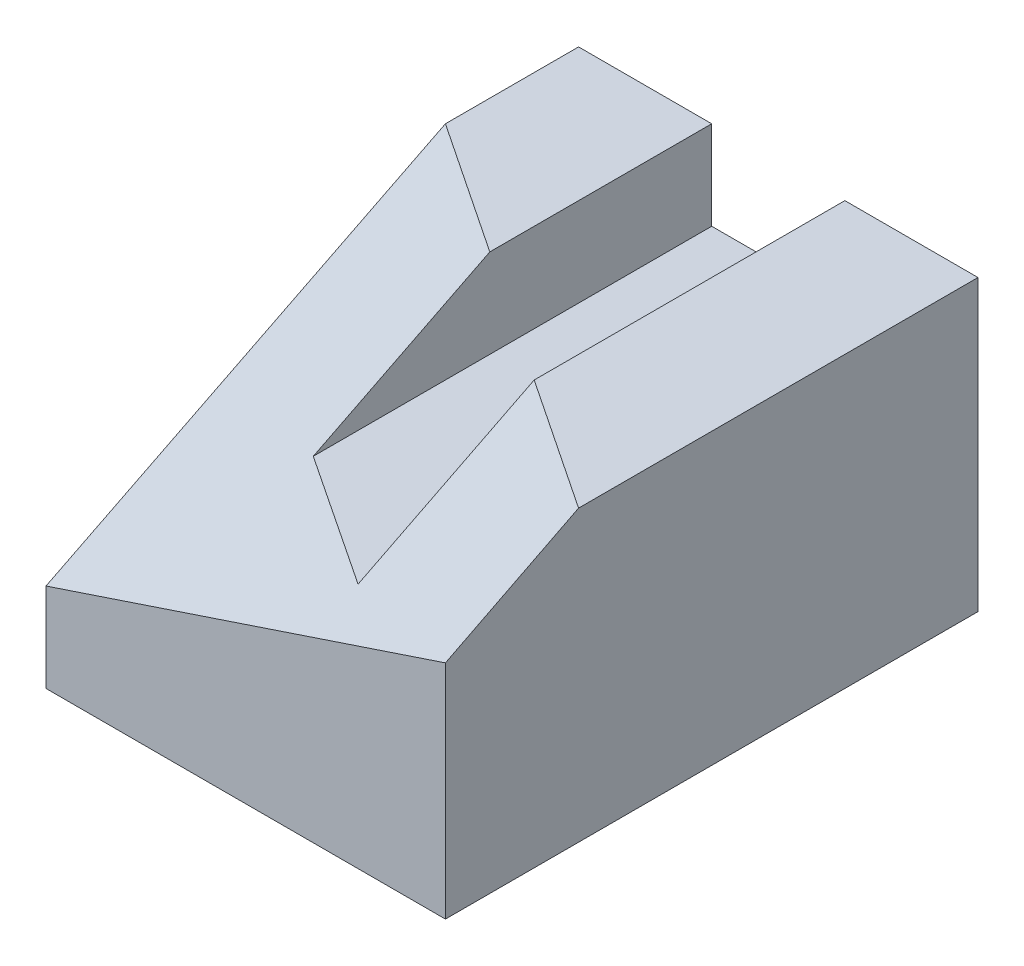
ISO-10303-21;
HEADER;
FILE_DESCRIPTION(('STEP AP214'),'2;1');
FILE_NAME('part.step','',(''),(''),'','','');
FILE_SCHEMA(('AUTOMOTIVE_DESIGN { 1 0 10303 214 1 1 1 1 }'));
ENDSEC;
DATA;
#1=APPLICATION_CONTEXT('core data for automotive mechanical design processes');
#2=APPLICATION_PROTOCOL_DEFINITION('international standard','automotive_design',2000,#1);
#3=PRODUCT_CONTEXT('',#1,'mechanical');
#4=PRODUCT('Part','Part','',(#3));
#5=PRODUCT_RELATED_PRODUCT_CATEGORY('part','',(#4));
#6=PRODUCT_DEFINITION_FORMATION('','',#4);
#7=PRODUCT_DEFINITION_CONTEXT('part definition',#1,'design');
#8=PRODUCT_DEFINITION('design','',#6,#7);
#9=PRODUCT_DEFINITION_SHAPE('','',#8);
#10=(LENGTH_UNIT() NAMED_UNIT(*) SI_UNIT(.MILLI.,.METRE.));
#11=(NAMED_UNIT(*) PLANE_ANGLE_UNIT() SI_UNIT($,.RADIAN.));
#12=(NAMED_UNIT(*) SI_UNIT($,.STERADIAN.) SOLID_ANGLE_UNIT());
#13=UNCERTAINTY_MEASURE_WITH_UNIT(LENGTH_MEASURE(1.E-05),#10,'distance_accuracy_value','');
#14=(GEOMETRIC_REPRESENTATION_CONTEXT(3) GLOBAL_UNCERTAINTY_ASSIGNED_CONTEXT((#13)) GLOBAL_UNIT_ASSIGNED_CONTEXT((#10,
#11,#12)) REPRESENTATION_CONTEXT('',''));
#15=CARTESIAN_POINT('',(0.,0.,0.));
#16=DIRECTION('',(0.,0.,1.));
#17=DIRECTION('',(1.,0.,0.));
#18=AXIS2_PLACEMENT_3D('',#15,#16,#17);
#19=CARTESIAN_POINT('',(0.,41.402,76.2));
#20=DIRECTION('',(1.,0.,0.));
#21=DIRECTION('',(0.,0.,-1.));
#22=AXIS2_PLACEMENT_3D('',#19,#20,#21);
#23=PLANE('',#22);
#24=CARTESIAN_POINT('',(-2.91809074732152E-05,41.4020872516244,19.0500439172954));
#25=CARTESIAN_POINT('',(-3.86726969360766E-06,40.2060948844264,21.4312558444124));
#26=CARTESIAN_POINT('',(1.08937333364729E-05,39.0101340837386,23.812483625628));
#27=CARTESIAN_POINT('',(2.7901925962563E-05,36.6182498990808,28.5749580211406));
#28=CARTESIAN_POINT('',(3.01491153867756E-05,35.4223265151114,30.9562046354378));
#29=CARTESIAN_POINT('',(3.07211366442106E-05,33.0304914748033,35.7187037678096));
#30=CARTESIAN_POINT('',(2.90459684589946E-05,31.8345798184648,38.0999562858842));
#31=CARTESIAN_POINT('',(2.85221628713324E-05,29.4427480526273,42.8624570716149));
#32=CARTESIAN_POINT('',(2.9673525464064E-05,28.2468279431284,45.243705339271));
#33=CARTESIAN_POINT('',(3.37831016135124E-05,25.8549823215601,50.0061991553545));
#34=CARTESIAN_POINT('',(3.67413151666484E-05,24.6590568094907,52.387444703782));
#35=CARTESIAN_POINT('',(4.33074200695613E-05,22.2672038421352,57.1499348241936));
#36=CARTESIAN_POINT('',(4.6915311419231E-05,21.0712763868492,59.5311793961778));
#37=CARTESIAN_POINT('',(5.06189575230314E-05,18.6794319771262,64.2936738269605));
#38=CARTESIAN_POINT('',(5.07147122619176E-05,17.4835150226893,66.6749236857591));
#39=CARTESIAN_POINT('',(4.08956505829022E-05,15.0917110457558,71.4374384690995));
#40=CARTESIAN_POINT('',(3.09808340523172E-05,13.8958240232596,73.8187033936416));
#41=CARTESIAN_POINT('',(1.28115145148336E-05,12.6999616931459,76.1999807188834));
#42=B_SPLINE_CURVE_WITH_KNOTS('',3,(#24,#25,#26,#27,#28,#29,#30,#31,#32,#33,#34,#35,#36,#37,#38,
#39,#40,#41),.UNSPECIFIED.,.F.,.F.,(4,2,2,2,2,2,2,2,4),(0.,7.99406729060848,15.9881346909643,
23.9822021288993,31.976269553196,39.9703369616497,47.9644043687831,55.9584718106146,
63.9525393424309),.UNSPECIFIED.);
#43=CARTESIAN_POINT('',(0.,12.6999738701639,76.2));
#44=VERTEX_POINT('',#43);
#45=CARTESIAN_POINT('',(0.,41.402,19.0501185446108));
#46=VERTEX_POINT('',#45);
#47=EDGE_CURVE('E90',#44,#46,#42,.F.);
#48=ORIENTED_EDGE('',*,*,#47,.T.);
#49=DIRECTION('',(0.,0.,-1.));
#50=VECTOR('',#49,1.);
#51=CARTESIAN_POINT('',(0.,41.402,76.2));
#52=LINE('',#51,#50);
#53=CARTESIAN_POINT('',(0.,41.402,0.));
#54=VERTEX_POINT('',#53);
#55=EDGE_CURVE('E131',#46,#54,#52,.T.);
#56=ORIENTED_EDGE('',*,*,#55,.T.);
#57=DIRECTION('',(0.,-1.,0.));
#58=VECTOR('',#57,1.);
#59=CARTESIAN_POINT('',(0.,41.402,0.));
#60=LINE('',#59,#58);
#61=CARTESIAN_POINT('',(0.,0.,0.));
#62=VERTEX_POINT('',#61);
#63=EDGE_CURVE('E135',#54,#62,#60,.T.);
#64=ORIENTED_EDGE('',*,*,#63,.T.);
#65=DIRECTION('',(0.,0.,-1.));
#66=VECTOR('',#65,1.);
#67=CARTESIAN_POINT('',(0.,0.,76.2));
#68=LINE('',#67,#66);
#69=CARTESIAN_POINT('',(0.,0.,76.2));
#70=VERTEX_POINT('',#69);
#71=EDGE_CURVE('E12',#70,#62,#68,.T.);
#72=ORIENTED_EDGE('',*,*,#71,.F.);
#73=DIRECTION('',(0.,-1.,0.));
#74=VECTOR('',#73,1.);
#75=CARTESIAN_POINT('',(0.,41.402,76.2));
#76=LINE('',#75,#74);
#77=EDGE_CURVE('E152',#44,#70,#76,.T.);
#78=ORIENTED_EDGE('',*,*,#77,.F.);
#79=EDGE_LOOP('',(#48,#56,#64,#72,#78));
#80=FACE_BOUND('',#79,.T.);
#81=ADVANCED_FACE('F71',(#80),#23,.F.);
#82=CARTESIAN_POINT('',(57.15,0.,76.2));
#83=DIRECTION('',(-1.,0.,0.));
#84=DIRECTION('',(0.,0.,1.));
#85=AXIS2_PLACEMENT_3D('',#82,#83,#84);
#86=PLANE('',#85);
#87=CARTESIAN_POINT('',(57.1498357322781,31.7504911659455,76.2002472201925));
#88=CARTESIAN_POINT('',(57.1498786890292,32.1525294469912,75.4064324594984));
#89=CARTESIAN_POINT('',(57.1499060467602,32.5546143101466,74.6126412924623));
#90=CARTESIAN_POINT('',(57.149935006437,33.358861047111,73.0250977204189));
#91=CARTESIAN_POINT('',(57.1499366083764,33.7610229209394,72.2313453154215));
#92=CARTESIAN_POINT('',(57.1499194987068,34.5654074030927,70.6438710842562));
#93=CARTESIAN_POINT('',(57.149900787094,34.9676300114297,69.8501492580945));
#94=CARTESIAN_POINT('',(57.1498530846375,35.7721059599499,68.2627210825443));
#95=CARTESIAN_POINT('',(57.1498240937928,36.1743593001362,67.4690147331575));
#96=CARTESIAN_POINT('',(57.1497702222967,36.9788536880135,65.8815958542968));
#97=CARTESIAN_POINT('',(57.149745341645,37.3810947357052,65.0878833248233));
#98=CARTESIAN_POINT('',(57.1497185257611,38.1855082188033,63.5004237427156));
#99=CARTESIAN_POINT('',(57.1497165905231,38.5876806542268,62.70667669009));
#100=CARTESIAN_POINT('',(57.1497636309434,39.3918733089801,61.1191059466711));
#101=CARTESIAN_POINT('',(57.1498126065775,39.7938935283825,60.3252822559144));
#102=CARTESIAN_POINT('',(57.1499832464399,40.597716625876,58.7375254792739));
#103=CARTESIAN_POINT('',(57.1501049106226,40.999519504103,57.9435923934589));
#104=CARTESIAN_POINT('',(57.1502738079575,41.4011813051102,57.1495879235721));
#105=B_SPLINE_CURVE_WITH_KNOTS('',3,(#87,#88,#89,#90,#91,#92,#93,#94,#95,#96,#97,#98,#99,#100,
#101,#102,#103,#104),.UNSPECIFIED.,.F.,.F.,(4,2,2,2,2,2,2,2,4),(0.,2.66945497720861,
5.33891062507232,8.00836680017314,10.6778232386596,13.3472795429308,16.016735185038,
18.6861895535327,21.3556422493235),.UNSPECIFIED.);
#106=CARTESIAN_POINT('',(57.15,41.402,57.1488935706619));
#107=VERTEX_POINT('',#106);
#108=CARTESIAN_POINT('',(57.15,31.7503355829927,76.2));
#109=VERTEX_POINT('',#108);
#110=EDGE_CURVE('E294',#107,#109,#105,.F.);
#111=ORIENTED_EDGE('',*,*,#110,.T.);
#112=DIRECTION('',(0.,1.,0.));
#113=VECTOR('',#112,1.);
#114=CARTESIAN_POINT('',(57.15,0.,76.2));
#115=LINE('',#114,#113);
#116=CARTESIAN_POINT('',(57.15,0.,76.2));
#117=VERTEX_POINT('',#116);
#118=EDGE_CURVE('E142',#117,#109,#115,.T.);
#119=ORIENTED_EDGE('',*,*,#118,.F.);
#120=DIRECTION('',(0.,0.,-1.));
#121=VECTOR('',#120,1.);
#122=CARTESIAN_POINT('',(57.15,0.,76.2));
#123=LINE('',#122,#121);
#124=CARTESIAN_POINT('',(57.15,0.,0.));
#125=VERTEX_POINT('',#124);
#126=EDGE_CURVE('E82',#117,#125,#123,.T.);
#127=ORIENTED_EDGE('',*,*,#126,.T.);
#128=DIRECTION('',(0.,1.,0.));
#129=VECTOR('',#128,1.);
#130=CARTESIAN_POINT('',(57.15,0.,0.));
#131=LINE('',#130,#129);
#132=CARTESIAN_POINT('',(57.15,41.402,0.));
#133=VERTEX_POINT('',#132);
#134=EDGE_CURVE('E163',#125,#133,#131,.T.);
#135=ORIENTED_EDGE('',*,*,#134,.T.);
#136=DIRECTION('',(0.,0.,-1.));
#137=VECTOR('',#136,1.);
#138=CARTESIAN_POINT('',(57.15,41.402,76.2));
#139=LINE('',#138,#137);
#140=EDGE_CURVE('E310',#107,#133,#139,.T.);
#141=ORIENTED_EDGE('',*,*,#140,.F.);
#142=EDGE_LOOP('',(#111,#119,#127,#135,#141));
#143=FACE_BOUND('',#142,.T.);
#144=ADVANCED_FACE('F334',(#143),#86,.F.);
#145=CARTESIAN_POINT('',(57.15,41.402,76.2));
#146=DIRECTION('',(0.,-1.,0.));
#147=DIRECTION('',(0.,0.,-1.));
#148=AXIS2_PLACEMENT_3D('',#145,#146,#147);
#149=PLANE('',#148);
#150=CARTESIAN_POINT('',(57.1502738079575,41.4011813051101,57.1495879235721));
#151=CARTESIAN_POINT('',(56.356397219837,41.4015616440852,56.620613103614));
#152=CARTESIAN_POINT('',(55.5625511410936,41.4018508696437,56.0915924479037));
#153=CARTESIAN_POINT('',(53.9749057358549,41.4022895299853,55.033480775126));
#154=CARTESIAN_POINT('',(53.1811064093637,41.4024389647563,54.5043897580525));
#155=CARTESIAN_POINT('',(51.5935403185633,41.4026404795367,53.4461587236243));
#156=CARTESIAN_POINT('',(50.7997735542567,41.4026925595384,52.9170187062655));
#157=CARTESIAN_POINT('',(49.2122609142742,41.4027342620101,51.8587072346279));
#158=CARTESIAN_POINT('',(48.4185150385995,41.4027238844763,51.3295357803471));
#159=CARTESIAN_POINT('',(46.8310347816854,41.4026687594675,50.2711755719813));
#160=CARTESIAN_POINT('',(46.0373004004462,41.4026240119913,49.7419868178956));
#161=CARTESIAN_POINT('',(44.4498361747791,41.4025209495707,48.6836024802632));
#162=CARTESIAN_POINT('',(43.6561063303511,41.4024626346263,48.1544068967164));
#163=CARTESIAN_POINT('',(42.0686463386201,41.4023469074693,47.0960161833569));
#164=CARTESIAN_POINT('',(41.2749161913171,41.4022894952568,46.5668210535442));
#165=CARTESIAN_POINT('',(39.6874530379899,41.4021832185025,45.5084350962465));
#166=CARTESIAN_POINT('',(38.8937200319659,41.4021343539607,44.9792442687614));
#167=CARTESIAN_POINT('',(38.0999843114575,41.4020935857229,44.4500575119357));
#168=B_SPLINE_CURVE_WITH_KNOTS('',3,(#150,#151,#152,#153,#154,#155,#156,#157,#158,#159,#160,
#161,#162,#163,#164,#165,#166,#167),.UNSPECIFIED.,.F.,.F.,(4,2,2,2,2,2,2,2,4),(0.,
2.86190334635929,5.72380694455233,8.58571077085884,11.4476147664134,14.309518864249,
17.1714230056915,20.0333271478418,22.8952312643818),.UNSPECIFIED.);
#169=CARTESIAN_POINT('',(38.1,41.402,44.4501269241652));
#170=VERTEX_POINT('',#169);
#171=EDGE_CURVE('E288',#170,#107,#168,.F.);
#172=ORIENTED_EDGE('',*,*,#171,.T.);
#173=ORIENTED_EDGE('',*,*,#140,.T.);
#174=DIRECTION('',(-1.,0.,0.));
#175=VECTOR('',#174,1.);
#176=CARTESIAN_POINT('',(57.15,41.402,0.));
#177=LINE('',#176,#175);
#178=CARTESIAN_POINT('',(38.1,41.402,0.));
#179=VERTEX_POINT('',#178);
#180=EDGE_CURVE('E175',#133,#179,#177,.T.);
#181=ORIENTED_EDGE('',*,*,#180,.T.);
#182=DIRECTION('',(0.,0.,-1.));
#183=VECTOR('',#182,1.);
#184=CARTESIAN_POINT('',(38.1,41.402,76.2));
#185=LINE('',#184,#183);
#186=EDGE_CURVE('E209',#170,#179,#185,.T.);
#187=ORIENTED_EDGE('',*,*,#186,.F.);
#188=EDGE_LOOP('',(#172,#173,#181,#187));
#189=FACE_BOUND('',#188,.T.);
#190=ADVANCED_FACE('F306',(#189),#149,.F.);
#191=CARTESIAN_POINT('',(38.1,41.402,76.2));
#192=DIRECTION('',(1.,0.,0.));
#193=DIRECTION('',(0.,0.,-1.));
#194=AXIS2_PLACEMENT_3D('',#191,#192,#193);
#195=PLANE('',#194);
#196=CARTESIAN_POINT('',(38.1,41.402,44.4502538483304));
#197=CARTESIAN_POINT('',(38.1,40.3444915757385,46.5506797572014));
#198=CARTESIAN_POINT('',(38.1,39.2867169144591,48.6509716064659));
#199=CARTESIAN_POINT('',(38.1,37.1707022640614,52.8513208214827));
#200=CARTESIAN_POINT('',(38.1,36.1124622749551,54.9513781872411));
#201=CARTESIAN_POINT('',(38.1,33.9955840664031,59.1512921676664));
#202=CARTESIAN_POINT('',(38.1,32.9369458469595,61.2511487823343));
#203=CARTESIAN_POINT('',(38.1,30.8195213794308,65.4507874483911));
#204=CARTESIAN_POINT('',(38.1,29.7607351313419,67.5505694997781));
#205=CARTESIAN_POINT('',(38.0999999999999,28.702,69.6503773035042));
#206=B_SPLINE_CURVE_WITH_KNOTS('',3,(#196,#197,#198,#199,#200,#201,#202,#203,#204,#205),
.UNSPECIFIED.,.F.,.F.,(4,2,2,2,4),(0.,7.05485769254466,14.1097152032002,21.16457267494,
28.2194303285688),.UNSPECIFIED.);
#207=CARTESIAN_POINT('',(38.1,28.702,69.6503773035042));
#208=VERTEX_POINT('',#207);
#209=EDGE_CURVE('E159',#170,#208,#206,.T.);
#210=ORIENTED_EDGE('',*,*,#209,.F.);
#211=ORIENTED_EDGE('',*,*,#186,.T.);
#212=DIRECTION('',(0.,-1.,0.));
#213=VECTOR('',#212,1.);
#214=CARTESIAN_POINT('',(38.1,41.402,0.));
#215=LINE('',#214,#213);
#216=CARTESIAN_POINT('',(38.1,28.702,0.));
#217=VERTEX_POINT('',#216);
#218=EDGE_CURVE('E179',#179,#217,#215,.T.);
#219=ORIENTED_EDGE('',*,*,#218,.T.);
#220=DIRECTION('',(0.,0.,-1.));
#221=VECTOR('',#220,1.);
#222=CARTESIAN_POINT('',(38.1,28.702,76.2));
#223=LINE('',#222,#221);
#224=EDGE_CURVE('E305',#208,#217,#223,.T.);
#225=ORIENTED_EDGE('',*,*,#224,.F.);
#226=EDGE_LOOP('',(#210,#211,#219,#225));
#227=FACE_BOUND('',#226,.T.);
#228=ADVANCED_FACE('F304',(#227),#195,.F.);
#229=CARTESIAN_POINT('',(38.1,28.702,76.2));
#230=DIRECTION('',(0.,-1.,0.));
#231=DIRECTION('',(0.,0.,-1.));
#232=AXIS2_PLACEMENT_3D('',#229,#230,#231);
#233=PLANE('',#232);
#234=CARTESIAN_POINT('',(38.1,28.702,69.6503773035042));
#235=CARTESIAN_POINT('',(36.5114664016894,28.702,68.5983746399323));
#236=CARTESIAN_POINT('',(34.9232921964086,28.702,67.5458296059487));
#237=CARTESIAN_POINT('',(31.7475050892172,28.702,65.4398935845226));
#238=CARTESIAN_POINT('',(30.1598921872174,28.702,64.3865025972146));
#239=CARTESIAN_POINT('',(26.9850697402661,28.702,62.2791131493097));
#240=CARTESIAN_POINT('',(25.3978601953043,28.702,61.2251146887286));
#241=CARTESIAN_POINT('',(22.2237359530104,28.702,59.116673329893));
#242=CARTESIAN_POINT('',(20.6368212557253,28.702,58.0622304315679));
#243=CARTESIAN_POINT('',(19.05,28.702,57.0076470131161));
#244=B_SPLINE_CURVE_WITH_KNOTS('',3,(#234,#235,#236,#237,#238,#239,#240,#241,#242,#243),
.UNSPECIFIED.,.F.,.F.,(4,2,2,2,4),(0.,5.71588429469036,11.431767681691,17.1476509218171,
22.8635350696328),.UNSPECIFIED.);
#245=CARTESIAN_POINT('',(19.05,28.702,57.0076470131161));
#246=VERTEX_POINT('',#245);
#247=EDGE_CURVE('E166',#208,#246,#244,.T.);
#248=ORIENTED_EDGE('',*,*,#247,.F.);
#249=ORIENTED_EDGE('',*,*,#224,.T.);
#250=DIRECTION('',(-1.,0.,0.));
#251=VECTOR('',#250,1.);
#252=CARTESIAN_POINT('',(38.1,28.702,0.));
#253=LINE('',#252,#251);
#254=CARTESIAN_POINT('',(19.05,28.702,0.));
#255=VERTEX_POINT('',#254);
#256=EDGE_CURVE('E183',#217,#255,#253,.T.);
#257=ORIENTED_EDGE('',*,*,#256,.T.);
#258=DIRECTION('',(0.,0.,-1.));
#259=VECTOR('',#258,1.);
#260=CARTESIAN_POINT('',(19.05,28.702,76.2));
#261=LINE('',#260,#259);
#262=EDGE_CURVE('E201',#246,#255,#261,.T.);
#263=ORIENTED_EDGE('',*,*,#262,.F.);
#264=EDGE_LOOP('',(#248,#249,#257,#263));
#265=FACE_BOUND('',#264,.T.);
#266=ADVANCED_FACE('F226',(#265),#233,.F.);
#267=CARTESIAN_POINT('',(19.05,28.702,76.2));
#268=DIRECTION('',(-1.,0.,0.));
#269=DIRECTION('',(0.,0.,1.));
#270=AXIS2_PLACEMENT_3D('',#267,#268,#269);
#271=PLANE('',#270);
#272=CARTESIAN_POINT('',(19.05,28.702,57.0076470131161));
#273=CARTESIAN_POINT('',(19.05,30.8189587749931,52.7982338417646));
#274=CARTESIAN_POINT('',(19.05,32.935771495823,48.5887472309146));
#275=CARTESIAN_POINT('',(19.05,37.1691048291563,40.1696271302178));
#276=CARTESIAN_POINT('',(19.05,39.2856254416597,35.959993640371));
#277=CARTESIAN_POINT('',(19.05,41.4019999999999,31.7502867110257));
#278=B_SPLINE_CURVE_WITH_KNOTS('',3,(#272,#273,#274,#275,#276,#277),.UNSPECIFIED.,.F.,.F.,(4,2,
4),(0.,14.1352772380993,28.2705544761987),.UNSPECIFIED.);
#279=CARTESIAN_POINT('',(19.05,41.402,31.7501433555129));
#280=VERTEX_POINT('',#279);
#281=EDGE_CURVE('E239',#246,#280,#278,.T.);
#282=ORIENTED_EDGE('',*,*,#281,.F.);
#283=ORIENTED_EDGE('',*,*,#262,.T.);
#284=DIRECTION('',(0.,1.,0.));
#285=VECTOR('',#284,1.);
#286=CARTESIAN_POINT('',(19.05,28.702,0.));
#287=LINE('',#286,#285);
#288=CARTESIAN_POINT('',(19.05,41.402,0.));
#289=VERTEX_POINT('',#288);
#290=EDGE_CURVE('E153',#255,#289,#287,.T.);
#291=ORIENTED_EDGE('',*,*,#290,.T.);
#292=DIRECTION('',(0.,0.,-1.));
#293=VECTOR('',#292,1.);
#294=CARTESIAN_POINT('',(19.05,41.402,76.2));
#295=LINE('',#294,#293);
#296=EDGE_CURVE('E141',#280,#289,#295,.T.);
#297=ORIENTED_EDGE('',*,*,#296,.F.);
#298=EDGE_LOOP('',(#282,#283,#291,#297));
#299=FACE_BOUND('',#298,.T.);
#300=ADVANCED_FACE('F222',(#299),#271,.F.);
#301=CARTESIAN_POINT('',(19.05,41.402,76.2));
#302=DIRECTION('',(0.,-1.,0.));
#303=DIRECTION('',(0.,0.,-1.));
#304=AXIS2_PLACEMENT_3D('',#301,#302,#303);
#305=PLANE('',#304);
#306=CARTESIAN_POINT('',(19.0500307705535,41.4021055875975,31.7500972015834));
#307=CARTESIAN_POINT('',(18.2562725238162,41.4021220087437,31.2209369637095));
#308=CARTESIAN_POINT('',(17.4625147990808,41.4021368725621,30.6917759427555));
#309=CARTESIAN_POINT('',(15.8750007126123,41.4021625247767,29.6334518495515));
#310=CARTESIAN_POINT('',(15.0812443508792,41.4021733131727,29.1042887773016));
#311=CARTESIAN_POINT('',(13.4937333118264,41.4021898537752,28.045960097978));
#312=CARTESIAN_POINT('',(12.6999786345066,41.4021956059816,27.5167944909044));
#313=CARTESIAN_POINT('',(11.1124710471365,41.4022018263845,26.4584606171799));
#314=CARTESIAN_POINT('',(10.3187181370861,41.4022022945809,25.929292350529));
#315=CARTESIAN_POINT('',(8.73121400629917,41.4021981800747,24.8709532749871));
#316=CARTESIAN_POINT('',(7.93746278556265,41.4021935973721,24.341782466096));
#317=CARTESIAN_POINT('',(6.34996178058207,41.4021801369867,23.2834386865477));
#318=CARTESIAN_POINT('',(5.55621199633803,41.4021712593041,22.7542657158903));
#319=CARTESIAN_POINT('',(3.96871346203845,41.4021504119532,21.6959182183368));
#320=CARTESIAN_POINT('',(3.17496471198292,41.402138442285,21.1667436914407));
#321=CARTESIAN_POINT('',(1.58746761803138,41.402113288518,20.1083940263852));
#322=CARTESIAN_POINT('',(0.793719274135367,41.4021001044192,19.5792188882258));
#323=CARTESIAN_POINT('',(-2.9180907479734E-05,41.4020872518828,19.050043916781));
#324=B_SPLINE_CURVE_WITH_KNOTS('',3,(#306,#307,#308,#309,#310,#311,#312,#313,#314,#315,#316,
#317,#318,#319,#320,#321,#322,#323),.UNSPECIFIED.,.F.,.F.,(4,2,2,2,2,2,2,2,4),(0.,
2.86191621242914,5.72383243593988,8.58574867291644,11.4476649242565,14.3095811894056,
17.1714974663791,20.0334137517466,22.8953300405462),.UNSPECIFIED.);
#325=EDGE_CURVE('E204',#46,#280,#324,.F.);
#326=ORIENTED_EDGE('',*,*,#325,.T.);
#327=ORIENTED_EDGE('',*,*,#296,.T.);
#328=DIRECTION('',(-1.,0.,0.));
#329=VECTOR('',#328,1.);
#330=CARTESIAN_POINT('',(19.05,41.402,0.));
#331=LINE('',#330,#329);
#332=EDGE_CURVE('E145',#289,#54,#331,.T.);
#333=ORIENTED_EDGE('',*,*,#332,.T.);
#334=ORIENTED_EDGE('',*,*,#55,.F.);
#335=EDGE_LOOP('',(#326,#327,#333,#334));
#336=FACE_BOUND('',#335,.T.);
#337=ADVANCED_FACE('F146',(#336),#305,.F.);
#338=CARTESIAN_POINT('',(0.,0.,76.2));
#339=DIRECTION('',(0.,0.,1.));
#340=DIRECTION('',(1.,0.,0.));
#341=AXIS2_PLACEMENT_3D('',#338,#339,#340);
#342=PLANE('',#341);
#343=ORIENTED_EDGE('',*,*,#118,.T.);
#344=CARTESIAN_POINT('',(1.28115145147929E-05,12.699961693146,76.1999807188834));
#345=CARTESIAN_POINT('',(2.3812897168177,13.4936311002676,76.1999401611279));
#346=CARTESIAN_POINT('',(4.76255021281954,14.2873497374724,76.1999243741477));
#347=CARTESIAN_POINT('',(9.52505035378511,15.8748493571788,76.1999241806534));
#348=CARTESIAN_POINT('',(11.9062899987494,16.6686303396787,76.1999397741384));
#349=CARTESIAN_POINT('',(16.6687605087892,18.2562185696327,76.1999841804895));
#350=CARTESIAN_POINT('',(19.0499913738649,19.0500258170866,76.2000129933554));
#351=CARTESIAN_POINT('',(23.8124651160756,20.6376043790693,76.2000525336796));
#352=CARTESIAN_POINT('',(26.1937079932108,21.4313756935977,76.2000632611377));
#353=CARTESIAN_POINT('',(30.956215611206,23.0188529194231,76.2000517979405));
#354=CARTESIAN_POINT('',(33.3374803520664,23.8125588307187,76.2000296072843));
#355=CARTESIAN_POINT('',(38.1000229625348,25.3999313552237,76.1999654480908));
#356=CARTESIAN_POINT('',(40.481300832143,26.1935979684327,76.1999234795531));
#357=CARTESIAN_POINT('',(45.2438389366225,27.7809838895994,76.1998660672027));
#358=CARTESIAN_POINT('',(47.6250991714943,28.5747031975556,76.1998506233891));
#359=CARTESIAN_POINT('',(52.3875412957785,30.1623760689945,76.1999376443771));
#360=CARTESIAN_POINT('',(54.7687231851982,30.9563296324556,76.2000401091677));
#361=CARTESIAN_POINT('',(57.1498357322781,31.7504911659455,76.2002472201925));
#362=B_SPLINE_CURVE_WITH_KNOTS('',3,(#344,#345,#346,#347,#348,#349,#350,#351,#352,#353,#354,
#355,#356,#357,#358,#359,#360,#361),.UNSPECIFIED.,.F.,.F.,(4,2,2,2,2,2,2,2,4),(0.,
7.53017379761687,15.0603473974493,22.590520929276,30.1206945559058,37.6508683611272,
45.1810422583715,52.7112159379869,60.2413889214289),.UNSPECIFIED.);
#363=EDGE_CURVE('E428',#109,#44,#362,.F.);
#364=ORIENTED_EDGE('',*,*,#363,.T.);
#365=ORIENTED_EDGE('',*,*,#77,.T.);
#366=DIRECTION('',(1.,0.,0.));
#367=VECTOR('',#366,1.);
#368=CARTESIAN_POINT('',(0.,0.,76.2));
#369=LINE('',#368,#367);
#370=EDGE_CURVE('E100',#70,#117,#369,.T.);
#371=ORIENTED_EDGE('',*,*,#370,.T.);
#372=EDGE_LOOP('',(#343,#364,#365,#371));
#373=FACE_BOUND('',#372,.T.);
#374=ADVANCED_FACE('F221',(#373),#342,.T.);
#375=CARTESIAN_POINT('',(0.,0.,76.2));
#376=DIRECTION('',(0.,1.,0.));
#377=DIRECTION('',(0.,0.,1.));
#378=AXIS2_PLACEMENT_3D('',#375,#376,#377);
#379=PLANE('',#378);
#380=DIRECTION('',(1.,0.,0.));
#381=VECTOR('',#380,1.);
#382=CARTESIAN_POINT('',(0.,0.,0.));
#383=LINE('',#382,#381);
#384=EDGE_CURVE('E157',#62,#125,#383,.T.);
#385=ORIENTED_EDGE('',*,*,#384,.T.);
#386=ORIENTED_EDGE('',*,*,#126,.F.);
#387=ORIENTED_EDGE('',*,*,#370,.F.);
#388=ORIENTED_EDGE('',*,*,#71,.T.);
#389=EDGE_LOOP('',(#385,#386,#387,#388));
#390=FACE_BOUND('',#389,.T.);
#391=ADVANCED_FACE('F339',(#390),#379,.F.);
#392=CARTESIAN_POINT('',(0.,0.,0.));
#393=DIRECTION('',(0.,0.,1.));
#394=DIRECTION('',(1.,0.,0.));
#395=AXIS2_PLACEMENT_3D('',#392,#393,#394);
#396=PLANE('',#395);
#397=ORIENTED_EDGE('',*,*,#63,.F.);
#398=ORIENTED_EDGE('',*,*,#332,.F.);
#399=ORIENTED_EDGE('',*,*,#290,.F.);
#400=ORIENTED_EDGE('',*,*,#256,.F.);
#401=ORIENTED_EDGE('',*,*,#218,.F.);
#402=ORIENTED_EDGE('',*,*,#180,.F.);
#403=ORIENTED_EDGE('',*,*,#134,.F.);
#404=ORIENTED_EDGE('',*,*,#384,.F.);
#405=EDGE_LOOP('',(#397,#398,#399,#400,#401,#402,#403,#404));
#406=FACE_BOUND('',#405,.T.);
#407=ADVANCED_FACE('F155',(#406),#396,.F.);
#408=CARTESIAN_POINT('',(-0.586923100326465,12.2568093687724,76.6929005243728));
#409=CARTESIAN_POINT('',(-0.585767894508852,14.3706791164984,72.484216186823));
#410=CARTESIAN_POINT('',(-0.584631671946265,16.4846056247877,68.2755604187568));
#411=CARTESIAN_POINT('',(-0.583512849359179,18.5985841595817,64.0669308373647));
#412=CARTESIAN_POINT('',(-0.581739807658118,21.959886273758,57.375102141102));
#413=CARTESIAN_POINT('',(-0.579967813139754,25.3211915190453,50.683275020832));
#414=CARTESIAN_POINT('',(-0.579309956034563,26.5685042207129,48.2000704308452));
#415=CARTESIAN_POINT('',(-0.577333939182063,30.3104350134791,40.7504529803924));
#416=CARTESIAN_POINT('',(-0.57534974994917,34.0523413705564,33.3008232306428));
#417=CARTESIAN_POINT('',(-0.574019809096796,36.5469242357595,28.3343926398093));
#418=CARTESIAN_POINT('',(-0.572723853551883,39.0416087181609,23.368013196299));
#419=CARTESIAN_POINT('',(-0.571457966349752,41.5363831059062,18.4016790051451));
#420=CARTESIAN_POINT('',(11.0776828154378,15.3600352079041,78.2547301631685));
#421=CARTESIAN_POINT('',(11.0784729161623,17.4749966319881,74.0465953027191));
#422=CARTESIAN_POINT('',(11.0792600257967,19.589966999531,69.8384649438105));
#423=CARTESIAN_POINT('',(11.0800029474813,21.7050694905119,65.6304010870325));
#424=CARTESIAN_POINT('',(11.0812327434887,25.0679959273605,58.9393899665149));
#425=CARTESIAN_POINT('',(11.0824795540767,28.4308714900476,52.2483532393361));
#426=CARTESIAN_POINT('',(11.0829467521679,29.6787542685011,49.7654355879983));
#427=CARTESIAN_POINT('',(11.0843580140675,33.4223736973391,42.3166680843682));
#428=CARTESIAN_POINT('',(11.0857850005083,37.1659461092765,34.8678769155649));
#429=CARTESIAN_POINT('',(11.0867937363441,39.6614893881503,29.9019297329457));
#430=CARTESIAN_POINT('',(11.0877329623116,42.1572405038397,24.9360871615237));
#431=CARTESIAN_POINT('',(11.0886450086245,44.6530728875994,19.9702854950304));
#432=CARTESIAN_POINT('',(22.7424794215603,18.4626908765294,79.8162728161431));
#433=CARTESIAN_POINT('',(22.7428644813226,20.578863386547,75.6087475356135));
#434=CARTESIAN_POINT('',(22.7431802767118,22.6952429993414,71.4013264968149));
#435=CARTESIAN_POINT('',(22.7435632111626,24.8114218641109,67.1938044148437));
#436=CARTESIAN_POINT('',(22.743878468634,28.1770828015655,60.5041696596312));
#437=CARTESIAN_POINT('',(22.744285361478,31.5424697462114,53.814396994705));
#438=CARTESIAN_POINT('',(22.7444595977858,32.7912284901302,51.3319202459846));
#439=CARTESIAN_POINT('',(22.7450962441128,36.5371640452651,43.884318525924));
#440=CARTESIAN_POINT('',(22.7460726254567,40.2820837814125,36.4362055103063));
#441=CARTESIAN_POINT('',(22.7465999822088,42.7790663997391,31.4709827952117));
#442=CARTESIAN_POINT('',(22.7471067621718,45.276110543349,26.505791047843));
#443=CARTESIAN_POINT('',(22.7476351094518,47.7730901999645,21.5405668420205));
#444=CARTESIAN_POINT('',(34.4068796721925,21.5665316612384,81.3784119775463));
#445=CARTESIAN_POINT('',(34.4068211336458,23.6840305449376,77.1715543051031));
#446=CARTESIAN_POINT('',(34.4067641286842,25.8015248431663,72.9646943246397));
#447=CARTESIAN_POINT('',(34.4065044314194,27.9196251981156,68.7581393927257));
#448=CARTESIAN_POINT('',(34.4065634028577,31.2860524393233,62.0688903437356));
#449=CARTESIAN_POINT('',(34.4064807965412,34.6529030027216,55.3798543669148));
#450=CARTESIAN_POINT('',(34.4064329564688,35.9023257623952,52.8977118394576));
#451=CARTESIAN_POINT('',(34.4062157316017,39.650814420768,45.4513951813601));
#452=CARTESIAN_POINT('',(34.4056790903615,43.4002581447086,38.0055592395984));
#453=CARTESIAN_POINT('',(34.405573252587,45.899134035706,33.0412894717481));
#454=CARTESIAN_POINT('',(34.4057087720471,48.3972882605537,28.0766564652691));
#455=CARTESIAN_POINT('',(34.4060242698274,50.8949043442448,23.111752594408));
#456=CARTESIAN_POINT('',(46.0749118974528,24.6595127211461,82.9350850774663));
#457=CARTESIAN_POINT('',(46.0735965283854,26.7807695698574,78.7301189140791));
#458=CARTESIAN_POINT('',(46.0720258632098,28.9027897624135,74.5255369670939));
#459=CARTESIAN_POINT('',(46.0703634926581,31.0250841570908,70.3210930351763));
#460=CARTESIAN_POINT('',(46.067530091722,34.4001596877903,63.6361969585637));
#461=CARTESIAN_POINT('',(46.0654129183207,37.7730936743657,56.9502229714087));
#462=CARTESIAN_POINT('',(46.0647201222474,39.0244448739091,54.4690510920193));
#463=CARTESIAN_POINT('',(46.062912278982,42.7776895341375,47.0251282881892));
#464=CARTESIAN_POINT('',(46.062381532722,46.5271156318912,39.57928347458));
#465=CARTESIAN_POINT('',(46.0625203116213,49.0252601109073,34.6146455626991));
#466=CARTESIAN_POINT('',(46.0628854525113,51.5227277600512,29.6496669797825));
#467=CARTESIAN_POINT('',(46.0635208884614,54.0193872179851,24.6842816072902));
#468=CARTESIAN_POINT('',(57.7434165354075,27.7510812514027,84.4910472041283));
#469=CARTESIAN_POINT('',(57.740597282722,29.8768347620949,80.288344360605));
#470=CARTESIAN_POINT('',(57.7375009918953,32.003416626033,76.086058454882));
#471=CARTESIAN_POINT('',(57.7339946157652,34.1312246586526,71.8843897207287));
#472=CARTESIAN_POINT('',(57.7276729732973,37.5167301474205,65.2047433896772));
#473=CARTESIAN_POINT('',(57.7223271504051,40.8993179032378,58.5236284663739));
#474=CARTESIAN_POINT('',(57.7207043057407,42.1534499789672,56.0438562946649));
#475=CARTESIAN_POINT('',(57.7172490151148,45.9116205615361,48.6024128717461));
#476=CARTESIAN_POINT('',(57.7168881013355,49.6605388545301,41.1563124630746));
#477=CARTESIAN_POINT('',(57.7173467230753,52.1577269928272,36.1911931930317));
#478=CARTESIAN_POINT('',(57.7179964530977,54.6543437110103,31.2257863081982));
#479=CARTESIAN_POINT('',(57.718915814727,57.1501542217309,26.2599736322753));
#480=B_SPLINE_SURFACE_WITH_KNOTS('',5,5,((#408,#409,#410,#411,#412,#413,#414,#415,#416,#417,
#418,#419),(#420,#421,#422,#423,#424,#425,#426,#427,#428,#429,#430,#431),(#432,#433,#434,#435,
#436,#437,#438,#439,#440,#441,#442,#443),(#444,#445,#446,#447,#448,#449,#450,#451,#452,#453,
#454,#455),(#456,#457,#458,#459,#460,#461,#462,#463,#464,#465,#466,#467),(#468,#469,#470,#471,
#472,#473,#474,#475,#476,#477,#478,#479)),.UNSPECIFIED.,.F.,.F.,.F.,(6,6),(6,3,3,6),
(-30.4271990029844,30.4275977126313),(-26.2486501371869,-2.70005516910906,11.194268091544,
38.9829146128501),.UNSPECIFIED.);
#481=ORIENTED_EDGE('',*,*,#209,.T.);
#482=ORIENTED_EDGE('',*,*,#247,.T.);
#483=ORIENTED_EDGE('',*,*,#281,.T.);
#484=ORIENTED_EDGE('',*,*,#325,.F.);
#485=ORIENTED_EDGE('',*,*,#47,.F.);
#486=ORIENTED_EDGE('',*,*,#363,.F.);
#487=ORIENTED_EDGE('',*,*,#110,.F.);
#488=ORIENTED_EDGE('',*,*,#171,.F.);
#489=EDGE_LOOP('',(#481,#482,#483,#484,#485,#486,#487,#488));
#490=FACE_BOUND('',#489,.T.);
#491=ADVANCED_FACE('F245',(#490),#480,.T.);
#492=CLOSED_SHELL('',(#81,#144,#190,#228,#266,#300,#337,#374,#391,#407,#491));
#493=MANIFOLD_SOLID_BREP('B2',#492);
#494=ADVANCED_BREP_SHAPE_REPRESENTATION('',(#18,#493),#14);
#495=SHAPE_DEFINITION_REPRESENTATION(#9,#494);
ENDSEC;
END-ISO-10303-21;
